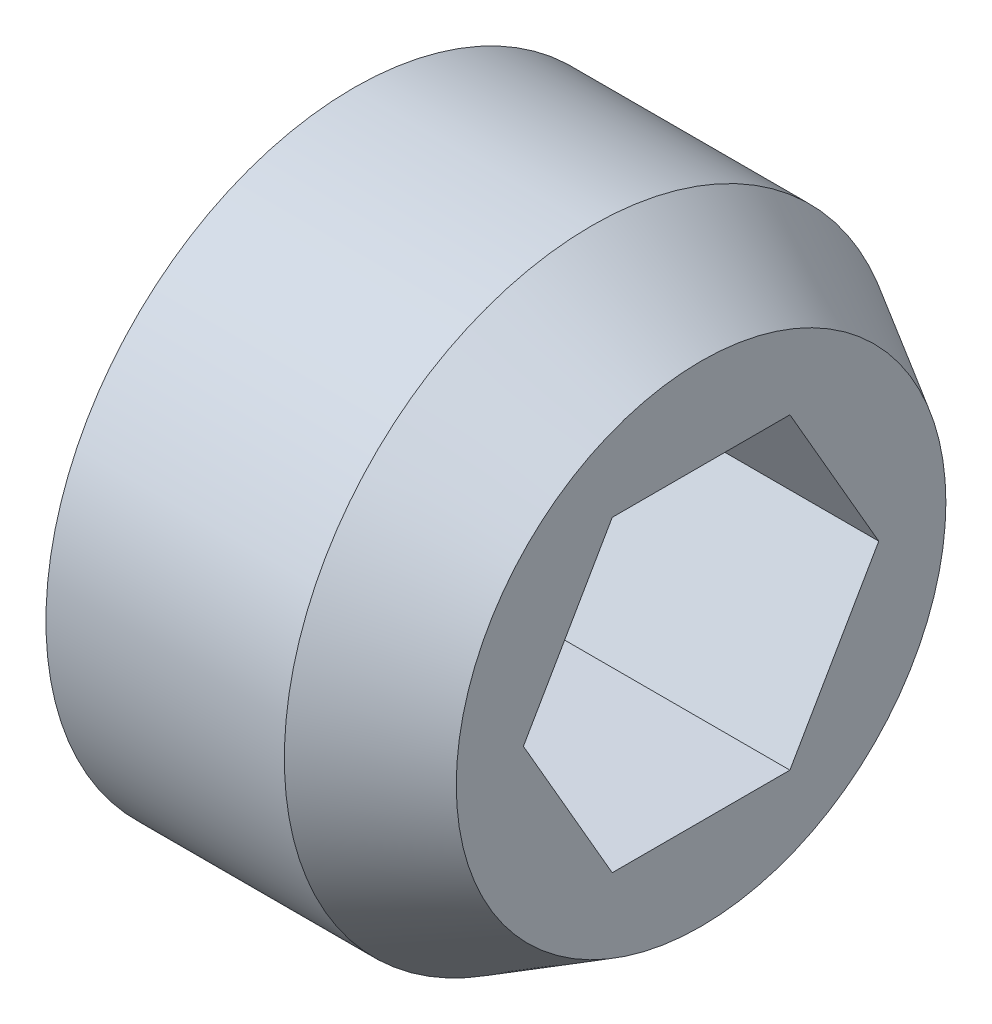
ISO-10303-21;
HEADER;
FILE_DESCRIPTION(('STEP AP214'),'2;1');
FILE_NAME('part.step','',(''),(''),'','','');
FILE_SCHEMA(('AUTOMOTIVE_DESIGN { 1 0 10303 214 1 1 1 1 }'));
ENDSEC;
DATA;
#1=APPLICATION_CONTEXT('core data for automotive mechanical design processes');
#2=APPLICATION_PROTOCOL_DEFINITION('international standard','automotive_design',2000,#1);
#3=PRODUCT_CONTEXT('',#1,'mechanical');
#4=PRODUCT('Part','Part','',(#3));
#5=PRODUCT_RELATED_PRODUCT_CATEGORY('part','',(#4));
#6=PRODUCT_DEFINITION_FORMATION('','',#4);
#7=PRODUCT_DEFINITION_CONTEXT('part definition',#1,'design');
#8=PRODUCT_DEFINITION('design','',#6,#7);
#9=PRODUCT_DEFINITION_SHAPE('','',#8);
#10=(LENGTH_UNIT() NAMED_UNIT(*) SI_UNIT(.MILLI.,.METRE.));
#11=(NAMED_UNIT(*) PLANE_ANGLE_UNIT() SI_UNIT($,.RADIAN.));
#12=(NAMED_UNIT(*) SI_UNIT($,.STERADIAN.) SOLID_ANGLE_UNIT());
#13=UNCERTAINTY_MEASURE_WITH_UNIT(LENGTH_MEASURE(1.E-05),#10,'distance_accuracy_value','');
#14=(GEOMETRIC_REPRESENTATION_CONTEXT(3) GLOBAL_UNCERTAINTY_ASSIGNED_CONTEXT((#13)) GLOBAL_UNIT_ASSIGNED_CONTEXT((#10,
#11,#12)) REPRESENTATION_CONTEXT('',''));
#15=CARTESIAN_POINT('',(0.,0.,0.));
#16=DIRECTION('',(0.,0.,1.));
#17=DIRECTION('',(1.,0.,0.));
#18=AXIS2_PLACEMENT_3D('',#15,#16,#17);
#19=CARTESIAN_POINT('',(0.55,0.,0.));
#20=DIRECTION('',(1.,0.,0.));
#21=DIRECTION('',(0.,1.,0.));
#22=AXIS2_PLACEMENT_3D('',#19,#20,#21);
#23=CONICAL_SURFACE('',#22,0.433012701892216,1.0471975511966);
#24=CARTESIAN_POINT('',(0.8,0.75,-0.433012701892215));
#25=CARTESIAN_POINT('',(0.675000000000003,0.749999999999995,0.));
#26=CARTESIAN_POINT('',(0.8,0.75,0.433012701892217));
#27=(BOUNDED_CURVE() B_SPLINE_CURVE(2,(#24,#25,#26),.UNSPECIFIED.,.F.,
.F.) B_SPLINE_CURVE_WITH_KNOTS((3,3),(0.,0.0876327103558432),
.UNSPECIFIED.) CURVE() GEOMETRIC_REPRESENTATION_ITEM() RATIONAL_B_SPLINE_CURVE((1.,
1.15470053837925,1.)) REPRESENTATION_ITEM(''));
#28=CARTESIAN_POINT('',(0.8,0.75,-0.433012701892216));
#29=VERTEX_POINT('',#28);
#30=CARTESIAN_POINT('',(0.8,0.75,0.433012701892217));
#31=VERTEX_POINT('',#30);
#32=EDGE_CURVE('E141',#29,#31,#27,.T.);
#33=ORIENTED_EDGE('',*,*,#32,.T.);
#34=CARTESIAN_POINT('',(0.8,0.75,0.433012701892217));
#35=CARTESIAN_POINT('',(0.675000000000003,0.374999999999996,0.64951905283833));
#36=CARTESIAN_POINT('',(0.8,0.,0.866025403784432));
#37=(BOUNDED_CURVE() B_SPLINE_CURVE(2,(#34,#35,#36),.UNSPECIFIED.,.F.,
.F.) B_SPLINE_CURVE_WITH_KNOTS((3,3),(0.,0.0876327103558432),
.UNSPECIFIED.) CURVE() GEOMETRIC_REPRESENTATION_ITEM() RATIONAL_B_SPLINE_CURVE((1.,
1.15470053837925,1.)) REPRESENTATION_ITEM(''));
#38=CARTESIAN_POINT('',(0.8,0.,0.866025403784432));
#39=VERTEX_POINT('',#38);
#40=EDGE_CURVE('E166',#31,#39,#37,.T.);
#41=ORIENTED_EDGE('',*,*,#40,.T.);
#42=CARTESIAN_POINT('',(0.8,0.,0.866025403784432));
#43=CARTESIAN_POINT('',(0.675000000000004,-0.374999999999999,0.649519052838324));
#44=CARTESIAN_POINT('',(0.8,-0.75,0.433012701892216));
#45=(BOUNDED_CURVE() B_SPLINE_CURVE(2,(#42,#43,#44),.UNSPECIFIED.,.F.,
.F.) B_SPLINE_CURVE_WITH_KNOTS((3,3),(0.,0.0876327103558429),
.UNSPECIFIED.) CURVE() GEOMETRIC_REPRESENTATION_ITEM() RATIONAL_B_SPLINE_CURVE((1.,
1.15470053837926,1.)) REPRESENTATION_ITEM(''));
#46=CARTESIAN_POINT('',(0.8,-0.75,0.433012701892216));
#47=VERTEX_POINT('',#46);
#48=EDGE_CURVE('E159',#39,#47,#45,.T.);
#49=ORIENTED_EDGE('',*,*,#48,.T.);
#50=CARTESIAN_POINT('',(0.8,-0.75,0.433012701892215));
#51=CARTESIAN_POINT('',(0.733012701892222,-0.749999999999995,0.20096189432334));
#52=CARTESIAN_POINT('',(0.733012701892222,-0.749999999999995,0.));
#53=(BOUNDED_CURVE() B_SPLINE_CURVE(2,(#50,#51,#52),.UNSPECIFIED.,.F.,
.F.) B_SPLINE_CURVE_WITH_KNOTS((3,3),(0.,0.0438163551779215),
.UNSPECIFIED.) CURVE() GEOMETRIC_REPRESENTATION_ITEM() RATIONAL_B_SPLINE_CURVE((1.,
1.07735026918963,1.07735026918963)) REPRESENTATION_ITEM(''));
#54=CARTESIAN_POINT('',(0.733012701892222,-0.75,0.));
#55=VERTEX_POINT('',#54);
#56=EDGE_CURVE('E156',#47,#55,#53,.T.);
#57=ORIENTED_EDGE('',*,*,#56,.T.);
#58=DIRECTION('',(-0.5,0.866025403784438,0.));
#59=VECTOR('',#58,1.);
#60=CARTESIAN_POINT('',(0.55,-0.433012701892216,0.));
#61=LINE('',#60,#59);
#62=CARTESIAN_POINT('',(0.300000000000005,0.,0.));
#63=VERTEX_POINT('',#62);
#64=EDGE_CURVE('E11',#55,#63,#61,.T.);
#65=ORIENTED_EDGE('',*,*,#64,.T.);
#66=ORIENTED_EDGE('',*,*,#64,.F.);
#67=CARTESIAN_POINT('',(0.733012701892222,-0.749999999999995,0.));
#68=CARTESIAN_POINT('',(0.733012701892222,-0.749999999999994,-0.200961894323341));
#69=CARTESIAN_POINT('',(0.8,-0.75,-0.433012701892217));
#70=(BOUNDED_CURVE() B_SPLINE_CURVE(2,(#67,#68,#69),.UNSPECIFIED.,.F.,
.F.) B_SPLINE_CURVE_WITH_KNOTS((3,3),(0.0438163551779215,0.0876327103558432),
.UNSPECIFIED.) CURVE() GEOMETRIC_REPRESENTATION_ITEM() RATIONAL_B_SPLINE_CURVE((1.07735026918963,
1.07735026918963,1.)) REPRESENTATION_ITEM(''));
#71=CARTESIAN_POINT('',(0.8,-0.75,-0.433012701892216));
#72=VERTEX_POINT('',#71);
#73=EDGE_CURVE('E21',#55,#72,#70,.T.);
#74=ORIENTED_EDGE('',*,*,#73,.T.);
#75=CARTESIAN_POINT('',(0.8,-0.75,-0.433012701892218));
#76=CARTESIAN_POINT('',(0.675000000000003,-0.374999999999996,-0.64951905283833));
#77=CARTESIAN_POINT('',(0.8,0.,-0.866025403784432));
#78=(BOUNDED_CURVE() B_SPLINE_CURVE(2,(#75,#76,#77),.UNSPECIFIED.,.F.,
.F.) B_SPLINE_CURVE_WITH_KNOTS((3,3),(0.,0.0876327103558432),
.UNSPECIFIED.) CURVE() GEOMETRIC_REPRESENTATION_ITEM() RATIONAL_B_SPLINE_CURVE((1.,
1.15470053837925,1.)) REPRESENTATION_ITEM(''));
#79=CARTESIAN_POINT('',(0.8,0.,-0.866025403784432));
#80=VERTEX_POINT('',#79);
#81=EDGE_CURVE('E189',#72,#80,#78,.T.);
#82=ORIENTED_EDGE('',*,*,#81,.T.);
#83=CARTESIAN_POINT('',(0.8,0.,-0.866025403784433));
#84=CARTESIAN_POINT('',(0.675000000000003,0.374999999999998,-0.64951905283833));
#85=CARTESIAN_POINT('',(0.8,0.75,-0.433012701892215));
#86=(BOUNDED_CURVE() B_SPLINE_CURVE(2,(#83,#84,#85),.UNSPECIFIED.,.F.,
.F.) B_SPLINE_CURVE_WITH_KNOTS((3,3),(0.,0.0876327103558432),
.UNSPECIFIED.) CURVE() GEOMETRIC_REPRESENTATION_ITEM() RATIONAL_B_SPLINE_CURVE((1.,
1.15470053837925,1.)) REPRESENTATION_ITEM(''));
#87=EDGE_CURVE('E194',#80,#29,#86,.T.);
#88=ORIENTED_EDGE('',*,*,#87,.T.);
#89=EDGE_LOOP('',(#33,#41,#49,#57,#65,#66,#74,#82,#88));
#90=FACE_BOUND('',#89,.T.);
#91=ADVANCED_FACE('F17',(#90),#23,.F.);
#92=CARTESIAN_POINT('',(1.73436835802422,0.,0.));
#93=DIRECTION('',(-1.,0.,0.));
#94=DIRECTION('',(0.,-1.,0.));
#95=AXIS2_PLACEMENT_3D('',#92,#93,#94);
#96=CONICAL_SURFACE('',#95,1.3466375,0.523598775598299);
#97=CARTESIAN_POINT('',(2.,0.,0.));
#98=DIRECTION('',(-1.,0.,0.));
#99=DIRECTION('',(0.,-1.,0.));
#100=AXIS2_PLACEMENT_3D('',#97,#98,#99);
#101=CIRCLE('',#100,1.193275);
#102=CARTESIAN_POINT('',(2.,1.193275,0.));
#103=VERTEX_POINT('',#102);
#104=EDGE_CURVE('E140',#103,#103,#101,.T.);
#105=ORIENTED_EDGE('',*,*,#104,.T.);
#106=DIRECTION('',(-0.866025403784439,0.5,0.));
#107=VECTOR('',#106,1.);
#108=CARTESIAN_POINT('',(1.73436835802422,1.3466375,0.));
#109=LINE('',#108,#107);
#110=CARTESIAN_POINT('',(1.46873671604844,1.5,0.));
#111=VERTEX_POINT('',#110);
#112=EDGE_CURVE('E30',#103,#111,#109,.T.);
#113=ORIENTED_EDGE('',*,*,#112,.T.);
#114=CARTESIAN_POINT('',(1.46873671604844,0.,0.));
#115=DIRECTION('',(1.,0.,0.));
#116=DIRECTION('',(0.,-1.,0.));
#117=AXIS2_PLACEMENT_3D('',#114,#115,#116);
#118=CIRCLE('',#117,1.5);
#119=CARTESIAN_POINT('',(1.46873671604844,-1.5,0.));
#120=VERTEX_POINT('',#119);
#121=EDGE_CURVE('E152',#111,#120,#118,.T.);
#122=ORIENTED_EDGE('',*,*,#121,.T.);
#123=CARTESIAN_POINT('',(1.46873671604844,0.,0.));
#124=DIRECTION('',(1.,0.,0.));
#125=DIRECTION('',(0.,-1.,0.));
#126=AXIS2_PLACEMENT_3D('',#123,#124,#125);
#127=CIRCLE('',#126,1.5);
#128=EDGE_CURVE('E160',#120,#111,#127,.T.);
#129=ORIENTED_EDGE('',*,*,#128,.T.);
#130=ORIENTED_EDGE('',*,*,#112,.F.);
#131=EDGE_LOOP('',(#105,#113,#122,#129,#130));
#132=FACE_BOUND('',#131,.T.);
#133=ADVANCED_FACE('F256',(#132),#96,.T.);
#134=CARTESIAN_POINT('',(2.,0.,0.));
#135=DIRECTION('',(-1.,0.,0.));
#136=DIRECTION('',(0.,1.,0.));
#137=AXIS2_PLACEMENT_3D('',#134,#135,#136);
#138=PLANE('',#137);
#139=DIRECTION('',(0.,0.,-1.));
#140=VECTOR('',#139,1.);
#141=CARTESIAN_POINT('',(2.,0.75,-0.216506350946107));
#142=LINE('',#141,#140);
#143=CARTESIAN_POINT('',(2.,0.75,0.433012701892217));
#144=VERTEX_POINT('',#143);
#145=CARTESIAN_POINT('',(2.,0.75,-0.433012701892215));
#146=VERTEX_POINT('',#145);
#147=EDGE_CURVE('E190',#144,#146,#142,.T.);
#148=ORIENTED_EDGE('',*,*,#147,.T.);
#149=DIRECTION('',(0.,-0.866025403784438,-0.5));
#150=VECTOR('',#149,1.);
#151=CARTESIAN_POINT('',(2.,0.1875,-0.757772228311378));
#152=LINE('',#151,#150);
#153=CARTESIAN_POINT('',(2.,0.,-0.866025403784432));
#154=VERTEX_POINT('',#153);
#155=EDGE_CURVE('E170',#146,#154,#152,.T.);
#156=ORIENTED_EDGE('',*,*,#155,.T.);
#157=DIRECTION('',(0.,-0.866025403784439,0.5));
#158=VECTOR('',#157,1.);
#159=CARTESIAN_POINT('',(2.,-0.5625,-0.541265877365271));
#160=LINE('',#159,#158);
#161=CARTESIAN_POINT('',(2.,-0.75,-0.433012701892217));
#162=VERTEX_POINT('',#161);
#163=EDGE_CURVE('E186',#154,#162,#160,.T.);
#164=ORIENTED_EDGE('',*,*,#163,.T.);
#165=DIRECTION('',(0.,0.,1.));
#166=VECTOR('',#165,1.);
#167=CARTESIAN_POINT('',(2.,-0.75,0.216506350946107));
#168=LINE('',#167,#166);
#169=CARTESIAN_POINT('',(2.,-0.75,0.433012701892215));
#170=VERTEX_POINT('',#169);
#171=EDGE_CURVE('E86',#162,#170,#168,.T.);
#172=ORIENTED_EDGE('',*,*,#171,.T.);
#173=DIRECTION('',(0.,0.866025403784438,0.5));
#174=VECTOR('',#173,1.);
#175=CARTESIAN_POINT('',(2.,-0.1875,0.757772228311378));
#176=LINE('',#175,#174);
#177=CARTESIAN_POINT('',(2.,0.,0.866025403784433));
#178=VERTEX_POINT('',#177);
#179=EDGE_CURVE('E229',#170,#178,#176,.T.);
#180=ORIENTED_EDGE('',*,*,#179,.T.);
#181=DIRECTION('',(0.,0.866025403784439,-0.5));
#182=VECTOR('',#181,1.);
#183=CARTESIAN_POINT('',(2.,0.5625,0.541265877365271));
#184=LINE('',#183,#182);
#185=EDGE_CURVE('E165',#178,#144,#184,.T.);
#186=ORIENTED_EDGE('',*,*,#185,.T.);
#187=EDGE_LOOP('',(#148,#156,#164,#172,#180,#186));
#188=FACE_BOUND('',#187,.T.);
#189=ORIENTED_EDGE('',*,*,#104,.F.);
#190=EDGE_LOOP('',(#189));
#191=FACE_BOUND('',#190,.T.);
#192=ADVANCED_FACE('F274',(#188,#191),#138,.F.);
#193=CARTESIAN_POINT('',(2.,0.,-0.866025403784433));
#194=DIRECTION('',(0.,0.5,-0.866025403784438));
#195=DIRECTION('',(-1.,0.,0.));
#196=AXIS2_PLACEMENT_3D('',#193,#194,#195);
#197=PLANE('',#196);
#198=ORIENTED_EDGE('',*,*,#87,.F.);
#199=DIRECTION('',(1.,0.,0.));
#200=VECTOR('',#199,1.);
#201=CARTESIAN_POINT('',(1.4,0.,-0.866025403784432));
#202=LINE('',#201,#200);
#203=EDGE_CURVE('E136',#80,#154,#202,.T.);
#204=ORIENTED_EDGE('',*,*,#203,.T.);
#205=ORIENTED_EDGE('',*,*,#155,.F.);
#206=DIRECTION('',(1.,0.,0.));
#207=VECTOR('',#206,1.);
#208=CARTESIAN_POINT('',(1.4,0.75,-0.433012701892216));
#209=LINE('',#208,#207);
#210=EDGE_CURVE('E145',#29,#146,#209,.T.);
#211=ORIENTED_EDGE('',*,*,#210,.F.);
#212=EDGE_LOOP('',(#198,#204,#205,#211));
#213=FACE_BOUND('',#212,.T.);
#214=ADVANCED_FACE('F240',(#213),#197,.F.);
#215=CARTESIAN_POINT('',(2.,0.75,-0.433012701892215));
#216=DIRECTION('',(0.,1.,0.));
#217=DIRECTION('',(0.,0.,-1.));
#218=AXIS2_PLACEMENT_3D('',#215,#216,#217);
#219=PLANE('',#218);
#220=ORIENTED_EDGE('',*,*,#32,.F.);
#221=ORIENTED_EDGE('',*,*,#210,.T.);
#222=ORIENTED_EDGE('',*,*,#147,.F.);
#223=DIRECTION('',(-1.,0.,0.));
#224=VECTOR('',#223,1.);
#225=CARTESIAN_POINT('',(1.4,0.75,0.433012701892217));
#226=LINE('',#225,#224);
#227=EDGE_CURVE('E161',#144,#31,#226,.T.);
#228=ORIENTED_EDGE('',*,*,#227,.T.);
#229=EDGE_LOOP('',(#220,#221,#222,#228));
#230=FACE_BOUND('',#229,.T.);
#231=ADVANCED_FACE('F237',(#230),#219,.F.);
#232=CARTESIAN_POINT('',(2.,-0.75,-0.433012701892217));
#233=DIRECTION('',(0.,-0.5,-0.866025403784439));
#234=DIRECTION('',(0.,-0.866025403784439,0.5));
#235=AXIS2_PLACEMENT_3D('',#232,#233,#234);
#236=PLANE('',#235);
#237=ORIENTED_EDGE('',*,*,#81,.F.);
#238=DIRECTION('',(1.,0.,0.));
#239=VECTOR('',#238,1.);
#240=CARTESIAN_POINT('',(1.4,-0.75,-0.433012701892217));
#241=LINE('',#240,#239);
#242=EDGE_CURVE('E155',#72,#162,#241,.T.);
#243=ORIENTED_EDGE('',*,*,#242,.T.);
#244=ORIENTED_EDGE('',*,*,#163,.F.);
#245=ORIENTED_EDGE('',*,*,#203,.F.);
#246=EDGE_LOOP('',(#237,#243,#244,#245));
#247=FACE_BOUND('',#246,.T.);
#248=ADVANCED_FACE('F318',(#247),#236,.F.);
#249=CARTESIAN_POINT('',(2.,0.75,0.433012701892217));
#250=DIRECTION('',(0.,0.5,0.866025403784439));
#251=DIRECTION('',(1.,0.,0.));
#252=AXIS2_PLACEMENT_3D('',#249,#250,#251);
#253=PLANE('',#252);
#254=ORIENTED_EDGE('',*,*,#40,.F.);
#255=ORIENTED_EDGE('',*,*,#227,.F.);
#256=ORIENTED_EDGE('',*,*,#185,.F.);
#257=DIRECTION('',(1.,0.,0.));
#258=VECTOR('',#257,1.);
#259=CARTESIAN_POINT('',(1.4,0.,0.866025403784432));
#260=LINE('',#259,#258);
#261=EDGE_CURVE('E179',#39,#178,#260,.T.);
#262=ORIENTED_EDGE('',*,*,#261,.F.);
#263=EDGE_LOOP('',(#254,#255,#256,#262));
#264=FACE_BOUND('',#263,.T.);
#265=ADVANCED_FACE('F280',(#264),#253,.F.);
#266=CARTESIAN_POINT('',(2.,-0.75,0.433012701892215));
#267=DIRECTION('',(0.,-1.,0.));
#268=DIRECTION('',(0.,0.,-1.));
#269=AXIS2_PLACEMENT_3D('',#266,#267,#268);
#270=PLANE('',#269);
#271=ORIENTED_EDGE('',*,*,#56,.F.);
#272=DIRECTION('',(1.,0.,0.));
#273=VECTOR('',#272,1.);
#274=CARTESIAN_POINT('',(1.4,-0.75,0.433012701892216));
#275=LINE('',#274,#273);
#276=EDGE_CURVE('E206',#47,#170,#275,.T.);
#277=ORIENTED_EDGE('',*,*,#276,.T.);
#278=ORIENTED_EDGE('',*,*,#171,.F.);
#279=ORIENTED_EDGE('',*,*,#242,.F.);
#280=ORIENTED_EDGE('',*,*,#73,.F.);
#281=EDGE_LOOP('',(#271,#277,#278,#279,#280));
#282=FACE_BOUND('',#281,.T.);
#283=ADVANCED_FACE('F19',(#282),#270,.F.);
#284=CARTESIAN_POINT('',(2.,0.,0.866025403784433));
#285=DIRECTION('',(0.,-0.5,0.866025403784438));
#286=DIRECTION('',(-1.,0.,0.));
#287=AXIS2_PLACEMENT_3D('',#284,#285,#286);
#288=PLANE('',#287);
#289=ORIENTED_EDGE('',*,*,#48,.F.);
#290=ORIENTED_EDGE('',*,*,#261,.T.);
#291=ORIENTED_EDGE('',*,*,#179,.F.);
#292=ORIENTED_EDGE('',*,*,#276,.F.);
#293=EDGE_LOOP('',(#289,#290,#291,#292));
#294=FACE_BOUND('',#293,.T.);
#295=ADVANCED_FACE('F284',(#294),#288,.F.);
#296=CARTESIAN_POINT('',(0.,0.75,0.));
#297=DIRECTION('',(-1.,0.,0.));
#298=DIRECTION('',(0.,1.,0.));
#299=AXIS2_PLACEMENT_3D('',#296,#297,#298);
#300=PLANE('',#299);
#301=CARTESIAN_POINT('',(0.,0.,0.));
#302=DIRECTION('',(1.,0.,0.));
#303=DIRECTION('',(0.,-1.,0.));
#304=AXIS2_PLACEMENT_3D('',#301,#302,#303);
#305=CIRCLE('',#304,0.968736716048436);
#306=CARTESIAN_POINT('',(0.,0.968736716048436,0.));
#307=VERTEX_POINT('',#306);
#308=EDGE_CURVE('E117',#307,#307,#305,.T.);
#309=ORIENTED_EDGE('',*,*,#308,.F.);
#310=EDGE_LOOP('',(#309));
#311=FACE_BOUND('',#310,.T.);
#312=ADVANCED_FACE('F291',(#311),#300,.T.);
#313=CARTESIAN_POINT('',(1.,0.,0.));
#314=DIRECTION('',(1.,0.,0.));
#315=DIRECTION('',(0.,1.,0.));
#316=AXIS2_PLACEMENT_3D('',#313,#314,#315);
#317=CYLINDRICAL_SURFACE('',#316,1.5);
#318=ORIENTED_EDGE('',*,*,#121,.F.);
#319=ORIENTED_EDGE('',*,*,#128,.F.);
#320=DIRECTION('',(-1.,0.,0.));
#321=VECTOR('',#320,1.);
#322=CARTESIAN_POINT('',(1.,-1.5,0.));
#323=LINE('',#322,#321);
#324=CARTESIAN_POINT('',(0.306725,-1.5,0.));
#325=VERTEX_POINT('',#324);
#326=EDGE_CURVE('E128',#120,#325,#323,.T.);
#327=ORIENTED_EDGE('',*,*,#326,.T.);
#328=CARTESIAN_POINT('',(0.306725,0.,0.));
#329=DIRECTION('',(-1.,0.,0.));
#330=DIRECTION('',(0.,-1.,0.));
#331=AXIS2_PLACEMENT_3D('',#328,#329,#330);
#332=CIRCLE('',#331,1.5);
#333=CARTESIAN_POINT('',(0.306725,1.5,0.));
#334=VERTEX_POINT('',#333);
#335=EDGE_CURVE('E115',#334,#325,#332,.T.);
#336=ORIENTED_EDGE('',*,*,#335,.F.);
#337=CARTESIAN_POINT('',(0.306725,0.,0.));
#338=DIRECTION('',(-1.,0.,0.));
#339=DIRECTION('',(0.,-1.,0.));
#340=AXIS2_PLACEMENT_3D('',#337,#338,#339);
#341=CIRCLE('',#340,1.5);
#342=EDGE_CURVE('E119',#325,#334,#341,.T.);
#343=ORIENTED_EDGE('',*,*,#342,.F.);
#344=ORIENTED_EDGE('',*,*,#326,.F.);
#345=EDGE_LOOP('',(#318,#319,#327,#336,#343,#344));
#346=FACE_BOUND('',#345,.T.);
#347=ADVANCED_FACE('F126',(#346),#317,.T.);
#348=CARTESIAN_POINT('',(0.1533625,0.,0.));
#349=DIRECTION('',(1.,0.,0.));
#350=DIRECTION('',(0.,-1.,0.));
#351=AXIS2_PLACEMENT_3D('',#348,#349,#350);
#352=CONICAL_SURFACE('',#351,1.23436835802422,1.0471975511966);
#353=ORIENTED_EDGE('',*,*,#335,.T.);
#354=ORIENTED_EDGE('',*,*,#342,.T.);
#355=DIRECTION('',(-0.5,-0.866025403784439,0.));
#356=VECTOR('',#355,1.);
#357=CARTESIAN_POINT('',(0.1533625,1.23436835802422,0.));
#358=LINE('',#357,#356);
#359=EDGE_CURVE('E111',#334,#307,#358,.T.);
#360=ORIENTED_EDGE('',*,*,#359,.T.);
#361=ORIENTED_EDGE('',*,*,#308,.T.);
#362=ORIENTED_EDGE('',*,*,#359,.F.);
#363=EDGE_LOOP('',(#353,#354,#360,#361,#362));
#364=FACE_BOUND('',#363,.T.);
#365=ADVANCED_FACE('F113',(#364),#352,.T.);
#366=CLOSED_SHELL('',(#91,#133,#192,#214,#231,#248,#265,#283,#295,#312,#347,#365));
#367=MANIFOLD_SOLID_BREP('B1',#366);
#368=ADVANCED_BREP_SHAPE_REPRESENTATION('',(#18,#367),#14);
#369=SHAPE_DEFINITION_REPRESENTATION(#9,#368);
ENDSEC;
END-ISO-10303-21;
